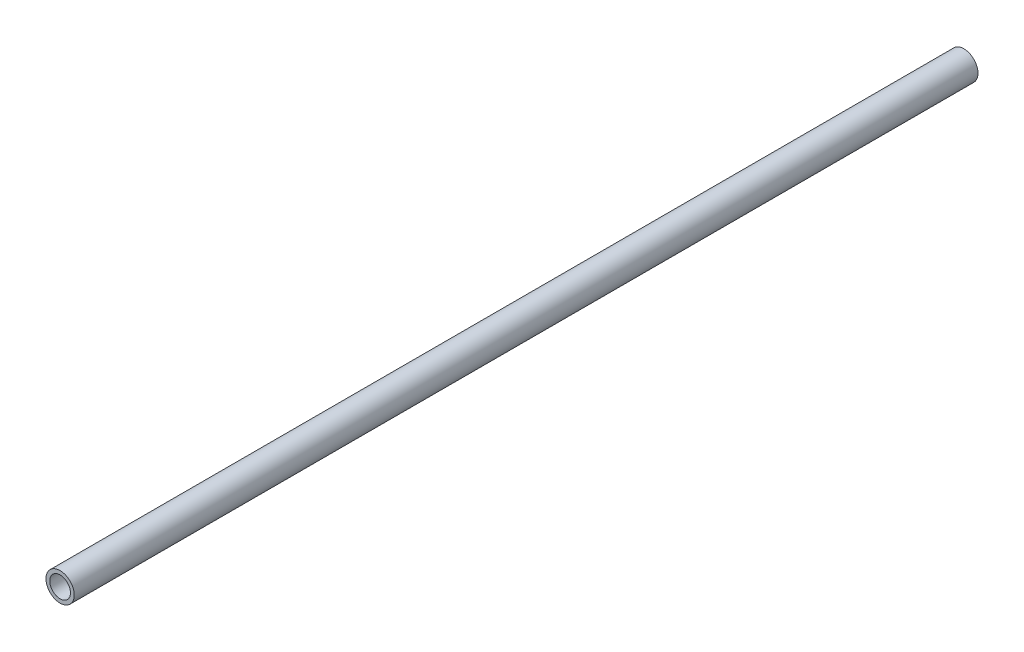
ISO-10303-21;
HEADER;
FILE_DESCRIPTION(('STEP AP214'),'2;1');
FILE_NAME('part.step','',(''),(''),'','','');
FILE_SCHEMA(('AUTOMOTIVE_DESIGN { 1 0 10303 214 1 1 1 1 }'));
ENDSEC;
DATA;
#1=APPLICATION_CONTEXT('core data for automotive mechanical design processes');
#2=APPLICATION_PROTOCOL_DEFINITION('international standard','automotive_design',2000,#1);
#3=PRODUCT_CONTEXT('',#1,'mechanical');
#4=PRODUCT('Part','Part','',(#3));
#5=PRODUCT_RELATED_PRODUCT_CATEGORY('part','',(#4));
#6=PRODUCT_DEFINITION_FORMATION('','',#4);
#7=PRODUCT_DEFINITION_CONTEXT('part definition',#1,'design');
#8=PRODUCT_DEFINITION('design','',#6,#7);
#9=PRODUCT_DEFINITION_SHAPE('','',#8);
#10=(LENGTH_UNIT() NAMED_UNIT(*) SI_UNIT(.MILLI.,.METRE.));
#11=(NAMED_UNIT(*) PLANE_ANGLE_UNIT() SI_UNIT($,.RADIAN.));
#12=(NAMED_UNIT(*) SI_UNIT($,.STERADIAN.) SOLID_ANGLE_UNIT());
#13=UNCERTAINTY_MEASURE_WITH_UNIT(LENGTH_MEASURE(1.E-05),#10,'distance_accuracy_value','');
#14=(GEOMETRIC_REPRESENTATION_CONTEXT(3) GLOBAL_UNCERTAINTY_ASSIGNED_CONTEXT((#13)) GLOBAL_UNIT_ASSIGNED_CONTEXT((#10,
#11,#12)) REPRESENTATION_CONTEXT('',''));
#15=CARTESIAN_POINT('',(0.,0.,0.));
#16=DIRECTION('',(0.,0.,1.));
#17=DIRECTION('',(1.,0.,0.));
#18=AXIS2_PLACEMENT_3D('',#15,#16,#17);
#19=CARTESIAN_POINT('',(0.,0.,609.6));
#20=DIRECTION('',(0.,0.,1.));
#21=DIRECTION('',(1.,0.,0.));
#22=AXIS2_PLACEMENT_3D('',#19,#20,#21);
#23=PLANE('',#22);
#24=CARTESIAN_POINT('',(0.,0.,609.6));
#25=DIRECTION('',(0.,0.,1.));
#26=DIRECTION('',(1.,0.,0.));
#27=AXIS2_PLACEMENT_3D('',#24,#25,#26);
#28=CIRCLE('',#27,9.525);
#29=CARTESIAN_POINT('',(9.525,0.,609.6));
#30=VERTEX_POINT('',#29);
#31=EDGE_CURVE('E10',#30,#30,#28,.T.);
#32=ORIENTED_EDGE('',*,*,#31,.T.);
#33=EDGE_LOOP('',(#32));
#34=FACE_BOUND('',#33,.T.);
#35=CARTESIAN_POINT('',(0.,0.,609.6));
#36=DIRECTION('',(0.,0.,1.));
#37=DIRECTION('',(1.,0.,0.));
#38=AXIS2_PLACEMENT_3D('',#35,#36,#37);
#39=CIRCLE('',#38,6.985);
#40=CARTESIAN_POINT('',(6.985,0.,609.6));
#41=VERTEX_POINT('',#40);
#42=EDGE_CURVE('E60',#41,#41,#39,.T.);
#43=ORIENTED_EDGE('',*,*,#42,.F.);
#44=EDGE_LOOP('',(#43));
#45=FACE_BOUND('',#44,.T.);
#46=ADVANCED_FACE('F47',(#34,#45),#23,.T.);
#47=CARTESIAN_POINT('',(0.,0.,0.));
#48=DIRECTION('',(0.,0.,1.));
#49=DIRECTION('',(1.,0.,0.));
#50=AXIS2_PLACEMENT_3D('',#47,#48,#49);
#51=PLANE('',#50);
#52=CARTESIAN_POINT('',(0.,0.,0.));
#53=DIRECTION('',(0.,0.,1.));
#54=DIRECTION('',(1.,0.,0.));
#55=AXIS2_PLACEMENT_3D('',#52,#53,#54);
#56=CIRCLE('',#55,9.525);
#57=CARTESIAN_POINT('',(9.525,0.,0.));
#58=VERTEX_POINT('',#57);
#59=EDGE_CURVE('E51',#58,#58,#56,.T.);
#60=ORIENTED_EDGE('',*,*,#59,.F.);
#61=EDGE_LOOP('',(#60));
#62=FACE_BOUND('',#61,.T.);
#63=CARTESIAN_POINT('',(0.,0.,0.));
#64=DIRECTION('',(0.,0.,1.));
#65=DIRECTION('',(1.,0.,0.));
#66=AXIS2_PLACEMENT_3D('',#63,#64,#65);
#67=CIRCLE('',#66,6.985);
#68=CARTESIAN_POINT('',(6.985,0.,0.));
#69=VERTEX_POINT('',#68);
#70=EDGE_CURVE('E62',#69,#69,#67,.T.);
#71=ORIENTED_EDGE('',*,*,#70,.T.);
#72=EDGE_LOOP('',(#71));
#73=FACE_BOUND('',#72,.T.);
#74=ADVANCED_FACE('F74',(#62,#73),#51,.F.);
#75=CARTESIAN_POINT('',(0.,0.,609.6));
#76=DIRECTION('',(0.,0.,-1.));
#77=DIRECTION('',(-1.,0.,0.));
#78=AXIS2_PLACEMENT_3D('',#75,#76,#77);
#79=CYLINDRICAL_SURFACE('',#78,9.525);
#80=ORIENTED_EDGE('',*,*,#31,.F.);
#81=EDGE_LOOP('',(#80));
#82=FACE_BOUND('',#81,.T.);
#83=ORIENTED_EDGE('',*,*,#59,.T.);
#84=EDGE_LOOP('',(#83));
#85=FACE_BOUND('',#84,.T.);
#86=ADVANCED_FACE('F49',(#82,#85),#79,.T.);
#87=CARTESIAN_POINT('',(0.,0.,609.6));
#88=DIRECTION('',(0.,0.,-1.));
#89=DIRECTION('',(-1.,0.,0.));
#90=AXIS2_PLACEMENT_3D('',#87,#88,#89);
#91=CYLINDRICAL_SURFACE('',#90,6.985);
#92=ORIENTED_EDGE('',*,*,#42,.T.);
#93=EDGE_LOOP('',(#92));
#94=FACE_BOUND('',#93,.T.);
#95=ORIENTED_EDGE('',*,*,#70,.F.);
#96=EDGE_LOOP('',(#95));
#97=FACE_BOUND('',#96,.T.);
#98=ADVANCED_FACE('F70',(#94,#97),#91,.F.);
#99=CLOSED_SHELL('',(#46,#74,#86,#98));
#100=MANIFOLD_SOLID_BREP('B2',#99);
#101=ADVANCED_BREP_SHAPE_REPRESENTATION('',(#18,#100),#14);
#102=SHAPE_DEFINITION_REPRESENTATION(#9,#101);
ENDSEC;
END-ISO-10303-21;
